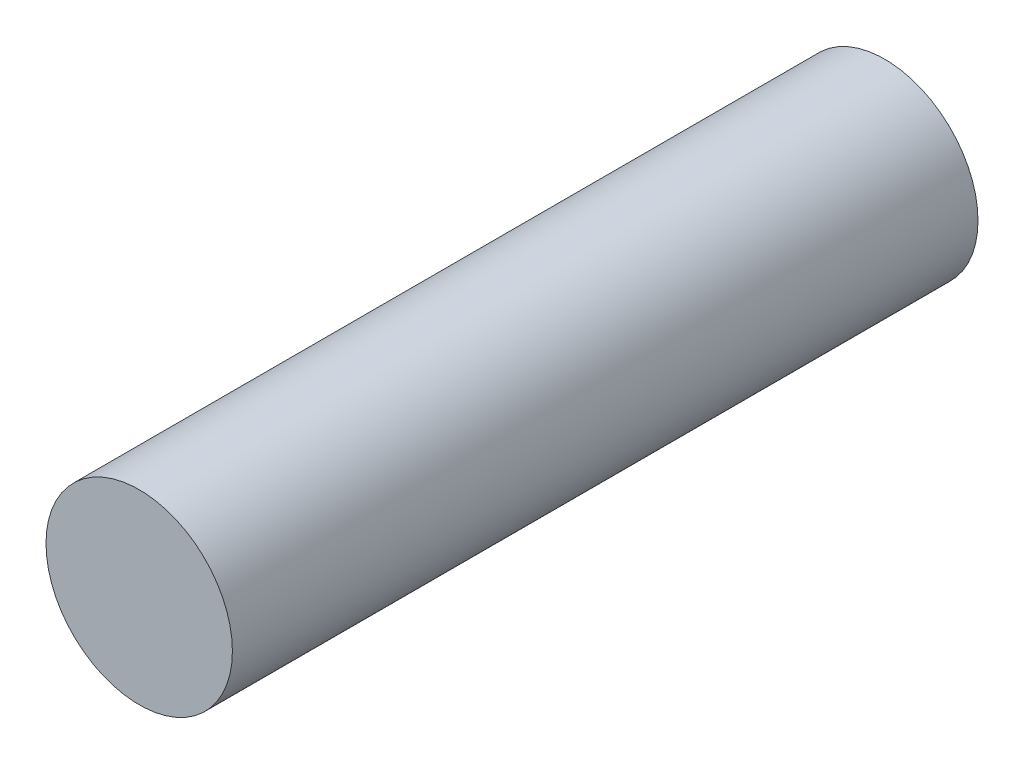
ISO-10303-21;
HEADER;
FILE_DESCRIPTION(('STEP AP214'),'2;1');
FILE_NAME('part.step','',(''),(''),'','','');
FILE_SCHEMA(('AUTOMOTIVE_DESIGN { 1 0 10303 214 1 1 1 1 }'));
ENDSEC;
DATA;
#1=APPLICATION_CONTEXT('core data for automotive mechanical design processes');
#2=APPLICATION_PROTOCOL_DEFINITION('international standard','automotive_design',2000,#1);
#3=PRODUCT_CONTEXT('',#1,'mechanical');
#4=PRODUCT('Part','Part','',(#3));
#5=PRODUCT_RELATED_PRODUCT_CATEGORY('part','',(#4));
#6=PRODUCT_DEFINITION_FORMATION('','',#4);
#7=PRODUCT_DEFINITION_CONTEXT('part definition',#1,'design');
#8=PRODUCT_DEFINITION('design','',#6,#7);
#9=PRODUCT_DEFINITION_SHAPE('','',#8);
#10=(LENGTH_UNIT() NAMED_UNIT(*) SI_UNIT(.MILLI.,.METRE.));
#11=(NAMED_UNIT(*) PLANE_ANGLE_UNIT() SI_UNIT($,.RADIAN.));
#12=(NAMED_UNIT(*) SI_UNIT($,.STERADIAN.) SOLID_ANGLE_UNIT());
#13=UNCERTAINTY_MEASURE_WITH_UNIT(LENGTH_MEASURE(1.E-05),#10,'distance_accuracy_value','');
#14=(GEOMETRIC_REPRESENTATION_CONTEXT(3) GLOBAL_UNCERTAINTY_ASSIGNED_CONTEXT((#13)) GLOBAL_UNIT_ASSIGNED_CONTEXT((#10,
#11,#12)) REPRESENTATION_CONTEXT('',''));
#15=CARTESIAN_POINT('',(0.,0.,0.));
#16=DIRECTION('',(0.,0.,1.));
#17=DIRECTION('',(1.,0.,0.));
#18=AXIS2_PLACEMENT_3D('',#15,#16,#17);
#19=CARTESIAN_POINT('',(0.,0.,12.));
#20=DIRECTION('',(0.,0.,-1.));
#21=DIRECTION('',(-1.,0.,0.));
#22=AXIS2_PLACEMENT_3D('',#19,#20,#21);
#23=CYLINDRICAL_SURFACE('',#22,1.5);
#24=CARTESIAN_POINT('',(0.,0.,12.));
#25=DIRECTION('',(0.,0.,1.));
#26=DIRECTION('',(1.,0.,0.));
#27=AXIS2_PLACEMENT_3D('',#24,#25,#26);
#28=CIRCLE('',#27,1.5);
#29=CARTESIAN_POINT('',(1.5,0.,12.));
#30=VERTEX_POINT('',#29);
#31=EDGE_CURVE('E10',#30,#30,#28,.T.);
#32=ORIENTED_EDGE('',*,*,#31,.F.);
#33=EDGE_LOOP('',(#32));
#34=FACE_BOUND('',#33,.T.);
#35=CARTESIAN_POINT('',(0.,0.,0.));
#36=DIRECTION('',(0.,0.,1.));
#37=DIRECTION('',(1.,0.,0.));
#38=AXIS2_PLACEMENT_3D('',#35,#36,#37);
#39=CIRCLE('',#38,1.5);
#40=CARTESIAN_POINT('',(1.5,0.,0.));
#41=VERTEX_POINT('',#40);
#42=EDGE_CURVE('E34',#41,#41,#39,.T.);
#43=ORIENTED_EDGE('',*,*,#42,.T.);
#44=EDGE_LOOP('',(#43));
#45=FACE_BOUND('',#44,.T.);
#46=ADVANCED_FACE('F31',(#34,#45),#23,.T.);
#47=CARTESIAN_POINT('',(0.,0.,12.));
#48=DIRECTION('',(0.,0.,1.));
#49=DIRECTION('',(1.,0.,0.));
#50=AXIS2_PLACEMENT_3D('',#47,#48,#49);
#51=PLANE('',#50);
#52=ORIENTED_EDGE('',*,*,#31,.T.);
#53=EDGE_LOOP('',(#52));
#54=FACE_BOUND('',#53,.T.);
#55=ADVANCED_FACE('F46',(#54),#51,.T.);
#56=CARTESIAN_POINT('',(0.,0.,0.));
#57=DIRECTION('',(0.,0.,1.));
#58=DIRECTION('',(1.,0.,0.));
#59=AXIS2_PLACEMENT_3D('',#56,#57,#58);
#60=PLANE('',#59);
#61=ORIENTED_EDGE('',*,*,#42,.F.);
#62=EDGE_LOOP('',(#61));
#63=FACE_BOUND('',#62,.T.);
#64=ADVANCED_FACE('F44',(#63),#60,.F.);
#65=CLOSED_SHELL('',(#46,#55,#64));
#66=MANIFOLD_SOLID_BREP('B2',#65);
#67=ADVANCED_BREP_SHAPE_REPRESENTATION('',(#18,#66),#14);
#68=SHAPE_DEFINITION_REPRESENTATION(#9,#67);
ENDSEC;
END-ISO-10303-21;
